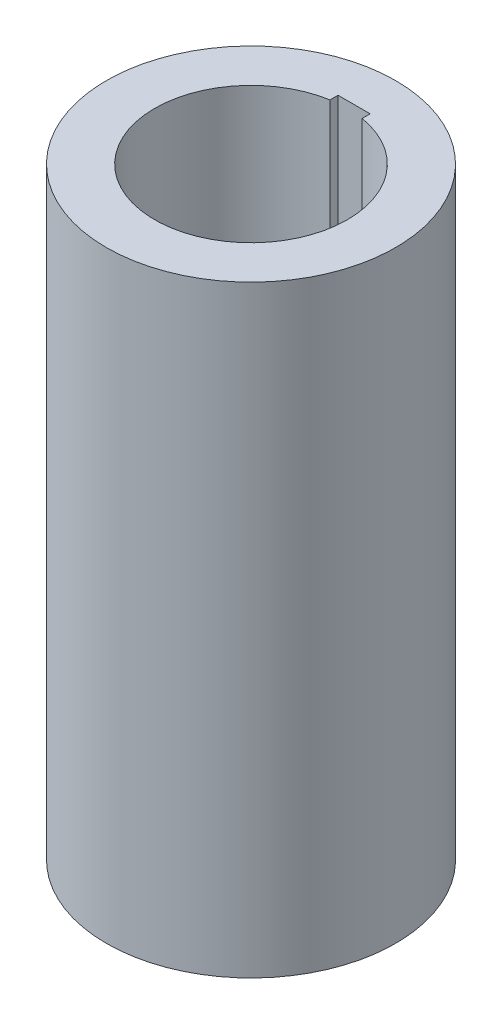
ISO-10303-21;
HEADER;
FILE_DESCRIPTION(('STEP AP214'),'2;1');
FILE_NAME('part.step','',(''),(''),'','','');
FILE_SCHEMA(('AUTOMOTIVE_DESIGN { 1 0 10303 214 1 1 1 1 }'));
ENDSEC;
DATA;
#1=APPLICATION_CONTEXT('core data for automotive mechanical design processes');
#2=APPLICATION_PROTOCOL_DEFINITION('international standard','automotive_design',2000,#1);
#3=PRODUCT_CONTEXT('',#1,'mechanical');
#4=PRODUCT('Part','Part','',(#3));
#5=PRODUCT_RELATED_PRODUCT_CATEGORY('part','',(#4));
#6=PRODUCT_DEFINITION_FORMATION('','',#4);
#7=PRODUCT_DEFINITION_CONTEXT('part definition',#1,'design');
#8=PRODUCT_DEFINITION('design','',#6,#7);
#9=PRODUCT_DEFINITION_SHAPE('','',#8);
#10=(LENGTH_UNIT() NAMED_UNIT(*) SI_UNIT(.MILLI.,.METRE.));
#11=(NAMED_UNIT(*) PLANE_ANGLE_UNIT() SI_UNIT($,.RADIAN.));
#12=(NAMED_UNIT(*) SI_UNIT($,.STERADIAN.) SOLID_ANGLE_UNIT());
#13=UNCERTAINTY_MEASURE_WITH_UNIT(LENGTH_MEASURE(1.E-05),#10,'distance_accuracy_value','');
#14=(GEOMETRIC_REPRESENTATION_CONTEXT(3) GLOBAL_UNCERTAINTY_ASSIGNED_CONTEXT((#13)) GLOBAL_UNIT_ASSIGNED_CONTEXT((#10,
#11,#12)) REPRESENTATION_CONTEXT('',''));
#15=CARTESIAN_POINT('',(0.,0.,0.));
#16=DIRECTION('',(0.,0.,1.));
#17=DIRECTION('',(1.,0.,0.));
#18=AXIS2_PLACEMENT_3D('',#15,#16,#17);
#19=CARTESIAN_POINT('',(0.,75.,0.));
#20=DIRECTION('',(0.,-1.,0.));
#21=DIRECTION('',(0.,0.,-1.));
#22=AXIS2_PLACEMENT_3D('',#19,#20,#21);
#23=CYLINDRICAL_SURFACE('',#22,12.);
#24=CARTESIAN_POINT('',(0.,0.,0.));
#25=DIRECTION('',(0.,1.,0.));
#26=DIRECTION('',(0.,0.,1.));
#27=AXIS2_PLACEMENT_3D('',#24,#25,#26);
#28=CIRCLE('',#27,12.);
#29=CARTESIAN_POINT('',(-2.,0.,-11.8321595661992));
#30=VERTEX_POINT('',#29);
#31=CARTESIAN_POINT('',(2.,0.,-11.8321595661992));
#32=VERTEX_POINT('',#31);
#33=EDGE_CURVE('E119',#30,#32,#28,.T.);
#34=ORIENTED_EDGE('',*,*,#33,.F.);
#35=DIRECTION('',(0.,-1.,0.));
#36=VECTOR('',#35,1.);
#37=CARTESIAN_POINT('',(-2.,75.,-11.8321595661992));
#38=LINE('',#37,#36);
#39=CARTESIAN_POINT('',(-2.,75.,-11.8321595661992));
#40=VERTEX_POINT('',#39);
#41=EDGE_CURVE('E11',#40,#30,#38,.T.);
#42=ORIENTED_EDGE('',*,*,#41,.F.);
#43=CARTESIAN_POINT('',(0.,75.,0.));
#44=DIRECTION('',(0.,1.,0.));
#45=DIRECTION('',(0.,0.,1.));
#46=AXIS2_PLACEMENT_3D('',#43,#44,#45);
#47=CIRCLE('',#46,12.);
#48=CARTESIAN_POINT('',(2.,75.,-11.8321595661992));
#49=VERTEX_POINT('',#48);
#50=EDGE_CURVE('E105',#40,#49,#47,.T.);
#51=ORIENTED_EDGE('',*,*,#50,.T.);
#52=DIRECTION('',(0.,-1.,0.));
#53=VECTOR('',#52,1.);
#54=CARTESIAN_POINT('',(2.,75.,-11.8321595661992));
#55=LINE('',#54,#53);
#56=EDGE_CURVE('E82',#49,#32,#55,.T.);
#57=ORIENTED_EDGE('',*,*,#56,.T.);
#58=EDGE_LOOP('',(#34,#42,#51,#57));
#59=FACE_BOUND('',#58,.T.);
#60=ADVANCED_FACE('F41',(#59),#23,.F.);
#61=CARTESIAN_POINT('',(-2.,75.,0.));
#62=DIRECTION('',(1.,0.,0.));
#63=DIRECTION('',(0.,0.,-1.));
#64=AXIS2_PLACEMENT_3D('',#61,#62,#63);
#65=PLANE('',#64);
#66=DIRECTION('',(0.,0.,1.));
#67=VECTOR('',#66,1.);
#68=CARTESIAN_POINT('',(-2.,0.,0.));
#69=LINE('',#68,#67);
#70=CARTESIAN_POINT('',(-2.,0.,-12.8321595661992));
#71=VERTEX_POINT('',#70);
#72=EDGE_CURVE('E94',#71,#30,#69,.T.);
#73=ORIENTED_EDGE('',*,*,#72,.F.);
#74=DIRECTION('',(0.,-1.,0.));
#75=VECTOR('',#74,1.);
#76=CARTESIAN_POINT('',(-2.,75.,-12.8321595661992));
#77=LINE('',#76,#75);
#78=CARTESIAN_POINT('',(-2.,75.,-12.8321595661992));
#79=VERTEX_POINT('',#78);
#80=EDGE_CURVE('E51',#79,#71,#77,.T.);
#81=ORIENTED_EDGE('',*,*,#80,.F.);
#82=DIRECTION('',(0.,0.,1.));
#83=VECTOR('',#82,1.);
#84=CARTESIAN_POINT('',(-2.,75.,0.));
#85=LINE('',#84,#83);
#86=EDGE_CURVE('E92',#79,#40,#85,.T.);
#87=ORIENTED_EDGE('',*,*,#86,.T.);
#88=ORIENTED_EDGE('',*,*,#41,.T.);
#89=EDGE_LOOP('',(#73,#81,#87,#88));
#90=FACE_BOUND('',#89,.T.);
#91=ADVANCED_FACE('F90',(#90),#65,.T.);
#92=CARTESIAN_POINT('',(0.,75.,-12.8321595661992));
#93=DIRECTION('',(0.,0.,-1.));
#94=DIRECTION('',(-1.,0.,0.));
#95=AXIS2_PLACEMENT_3D('',#92,#93,#94);
#96=PLANE('',#95);
#97=DIRECTION('',(1.,0.,0.));
#98=VECTOR('',#97,1.);
#99=CARTESIAN_POINT('',(0.,0.,-12.8321595661992));
#100=LINE('',#99,#98);
#101=CARTESIAN_POINT('',(2.,0.,-12.8321595661992));
#102=VERTEX_POINT('',#101);
#103=EDGE_CURVE('E124',#71,#102,#100,.T.);
#104=ORIENTED_EDGE('',*,*,#103,.T.);
#105=DIRECTION('',(0.,-1.,0.));
#106=VECTOR('',#105,1.);
#107=CARTESIAN_POINT('',(2.,75.,-12.8321595661992));
#108=LINE('',#107,#106);
#109=CARTESIAN_POINT('',(2.,75.,-12.8321595661992));
#110=VERTEX_POINT('',#109);
#111=EDGE_CURVE('E98',#110,#102,#108,.T.);
#112=ORIENTED_EDGE('',*,*,#111,.F.);
#113=DIRECTION('',(1.,0.,0.));
#114=VECTOR('',#113,1.);
#115=CARTESIAN_POINT('',(0.,75.,-12.8321595661992));
#116=LINE('',#115,#114);
#117=EDGE_CURVE('E100',#79,#110,#116,.T.);
#118=ORIENTED_EDGE('',*,*,#117,.F.);
#119=ORIENTED_EDGE('',*,*,#80,.T.);
#120=EDGE_LOOP('',(#104,#112,#118,#119));
#121=FACE_BOUND('',#120,.T.);
#122=ADVANCED_FACE('F101',(#121),#96,.F.);
#123=CARTESIAN_POINT('',(0.,75.,0.));
#124=DIRECTION('',(0.,-1.,0.));
#125=DIRECTION('',(0.,0.,-1.));
#126=AXIS2_PLACEMENT_3D('',#123,#124,#125);
#127=CYLINDRICAL_SURFACE('',#126,18.);
#128=CARTESIAN_POINT('',(0.,75.,0.));
#129=DIRECTION('',(0.,1.,0.));
#130=DIRECTION('',(0.,0.,1.));
#131=AXIS2_PLACEMENT_3D('',#128,#129,#130);
#132=CIRCLE('',#131,18.);
#133=CARTESIAN_POINT('',(0.,75.,18.));
#134=VERTEX_POINT('',#133);
#135=EDGE_CURVE('E109',#134,#134,#132,.T.);
#136=ORIENTED_EDGE('',*,*,#135,.F.);
#137=EDGE_LOOP('',(#136));
#138=FACE_BOUND('',#137,.T.);
#139=CARTESIAN_POINT('',(0.,0.,0.));
#140=DIRECTION('',(0.,1.,0.));
#141=DIRECTION('',(0.,0.,1.));
#142=AXIS2_PLACEMENT_3D('',#139,#140,#141);
#143=CIRCLE('',#142,18.);
#144=CARTESIAN_POINT('',(0.,0.,18.));
#145=VERTEX_POINT('',#144);
#146=EDGE_CURVE('E115',#145,#145,#143,.T.);
#147=ORIENTED_EDGE('',*,*,#146,.T.);
#148=EDGE_LOOP('',(#147));
#149=FACE_BOUND('',#148,.T.);
#150=ADVANCED_FACE('F43',(#138,#149),#127,.T.);
#151=CARTESIAN_POINT('',(1.99999999999999,75.,0.));
#152=DIRECTION('',(1.,0.,0.));
#153=DIRECTION('',(0.,0.,-1.));
#154=AXIS2_PLACEMENT_3D('',#151,#152,#153);
#155=PLANE('',#154);
#156=DIRECTION('',(0.,0.,1.));
#157=VECTOR('',#156,1.);
#158=CARTESIAN_POINT('',(1.99999999999999,0.,0.));
#159=LINE('',#158,#157);
#160=EDGE_CURVE('E75',#102,#32,#159,.T.);
#161=ORIENTED_EDGE('',*,*,#160,.T.);
#162=ORIENTED_EDGE('',*,*,#56,.F.);
#163=DIRECTION('',(0.,0.,1.));
#164=VECTOR('',#163,1.);
#165=CARTESIAN_POINT('',(1.99999999999999,75.,0.));
#166=LINE('',#165,#164);
#167=EDGE_CURVE('E59',#110,#49,#166,.T.);
#168=ORIENTED_EDGE('',*,*,#167,.F.);
#169=ORIENTED_EDGE('',*,*,#111,.T.);
#170=EDGE_LOOP('',(#161,#162,#168,#169));
#171=FACE_BOUND('',#170,.T.);
#172=ADVANCED_FACE('F133',(#171),#155,.F.);
#173=CARTESIAN_POINT('',(0.,75.,0.));
#174=DIRECTION('',(0.,1.,0.));
#175=DIRECTION('',(0.,0.,1.));
#176=AXIS2_PLACEMENT_3D('',#173,#174,#175);
#177=PLANE('',#176);
#178=ORIENTED_EDGE('',*,*,#135,.T.);
#179=EDGE_LOOP('',(#178));
#180=FACE_BOUND('',#179,.T.);
#181=ORIENTED_EDGE('',*,*,#50,.F.);
#182=ORIENTED_EDGE('',*,*,#86,.F.);
#183=ORIENTED_EDGE('',*,*,#117,.T.);
#184=ORIENTED_EDGE('',*,*,#167,.T.);
#185=EDGE_LOOP('',(#181,#182,#183,#184));
#186=FACE_BOUND('',#185,.T.);
#187=ADVANCED_FACE('F104',(#180,#186),#177,.T.);
#188=CARTESIAN_POINT('',(0.,0.,0.));
#189=DIRECTION('',(0.,1.,0.));
#190=DIRECTION('',(0.,0.,1.));
#191=AXIS2_PLACEMENT_3D('',#188,#189,#190);
#192=PLANE('',#191);
#193=ORIENTED_EDGE('',*,*,#146,.F.);
#194=EDGE_LOOP('',(#193));
#195=FACE_BOUND('',#194,.T.);
#196=ORIENTED_EDGE('',*,*,#33,.T.);
#197=ORIENTED_EDGE('',*,*,#160,.F.);
#198=ORIENTED_EDGE('',*,*,#103,.F.);
#199=ORIENTED_EDGE('',*,*,#72,.T.);
#200=EDGE_LOOP('',(#196,#197,#198,#199));
#201=FACE_BOUND('',#200,.T.);
#202=ADVANCED_FACE('F134',(#195,#201),#192,.F.);
#203=CLOSED_SHELL('',(#60,#91,#122,#150,#172,#187,#202));
#204=MANIFOLD_SOLID_BREP('B2',#203);
#205=ADVANCED_BREP_SHAPE_REPRESENTATION('',(#18,#204),#14);
#206=SHAPE_DEFINITION_REPRESENTATION(#9,#205);
ENDSEC;
END-ISO-10303-21;
